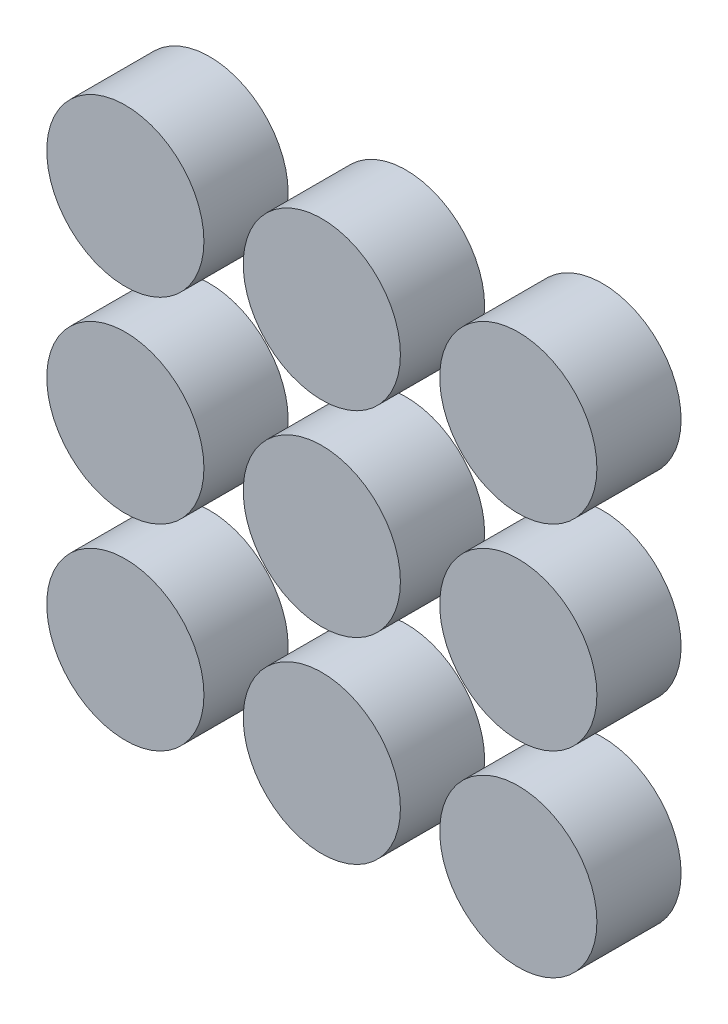
ISO-10303-21;
HEADER;
FILE_DESCRIPTION(('STEP AP214'),'2;1');
FILE_NAME('part.step','',(''),(''),'','','');
FILE_SCHEMA(('AUTOMOTIVE_DESIGN { 1 0 10303 214 1 1 1 1 }'));
ENDSEC;
DATA;
#1=APPLICATION_CONTEXT('core data for automotive mechanical design processes');
#2=APPLICATION_PROTOCOL_DEFINITION('international standard','automotive_design',2000,#1);
#3=PRODUCT_CONTEXT('',#1,'mechanical');
#4=PRODUCT('Part','Part','',(#3));
#5=PRODUCT_RELATED_PRODUCT_CATEGORY('part','',(#4));
#6=PRODUCT_DEFINITION_FORMATION('','',#4);
#7=PRODUCT_DEFINITION_CONTEXT('part definition',#1,'design');
#8=PRODUCT_DEFINITION('design','',#6,#7);
#9=PRODUCT_DEFINITION_SHAPE('','',#8);
#10=(LENGTH_UNIT() NAMED_UNIT(*) SI_UNIT(.MILLI.,.METRE.));
#11=(NAMED_UNIT(*) PLANE_ANGLE_UNIT() SI_UNIT($,.RADIAN.));
#12=(NAMED_UNIT(*) SI_UNIT($,.STERADIAN.) SOLID_ANGLE_UNIT());
#13=UNCERTAINTY_MEASURE_WITH_UNIT(LENGTH_MEASURE(1.E-05),#10,'distance_accuracy_value','');
#14=(GEOMETRIC_REPRESENTATION_CONTEXT(3) GLOBAL_UNCERTAINTY_ASSIGNED_CONTEXT((#13)) GLOBAL_UNIT_ASSIGNED_CONTEXT((#10,
#11,#12)) REPRESENTATION_CONTEXT('',''));
#15=CARTESIAN_POINT('',(0.,0.,0.));
#16=DIRECTION('',(0.,0.,1.));
#17=DIRECTION('',(1.,0.,0.));
#18=AXIS2_PLACEMENT_3D('',#15,#16,#17);
#19=CARTESIAN_POINT('',(-4.46373076906319,-6.71492943372793,13.));
#20=DIRECTION('',(0.,0.,1.));
#21=DIRECTION('',(1.,0.,0.));
#22=AXIS2_PLACEMENT_3D('',#19,#20,#21);
#23=PLANE('',#22);
#24=CARTESIAN_POINT('',(-4.46373076906319,-6.71492943372793,13.));
#25=DIRECTION('',(0.,0.,1.));
#26=DIRECTION('',(1.,0.,0.));
#27=AXIS2_PLACEMENT_3D('',#24,#25,#26);
#28=CIRCLE('',#27,2.8);
#29=CARTESIAN_POINT('',(-1.6637307690632,-6.71492943372793,13.));
#30=VERTEX_POINT('',#29);
#31=EDGE_CURVE('E46',#30,#30,#28,.T.);
#32=ORIENTED_EDGE('',*,*,#31,.T.);
#33=EDGE_LOOP('',(#32));
#34=FACE_BOUND('',#33,.T.);
#35=ADVANCED_FACE('F39',(#34),#23,.T.);
#36=CARTESIAN_POINT('',(-4.46373076906319,-6.71492943372793,13.));
#37=DIRECTION('',(0.,0.,-1.));
#38=DIRECTION('',(-1.,0.,0.));
#39=AXIS2_PLACEMENT_3D('',#36,#37,#38);
#40=CYLINDRICAL_SURFACE('',#39,2.8);
#41=ORIENTED_EDGE('',*,*,#31,.F.);
#42=EDGE_LOOP('',(#41));
#43=FACE_BOUND('',#42,.T.);
#44=CARTESIAN_POINT('',(-4.46373076906319,-6.71492943372793,10.));
#45=DIRECTION('',(0.,0.,1.));
#46=DIRECTION('',(1.,0.,0.));
#47=AXIS2_PLACEMENT_3D('',#44,#45,#46);
#48=CIRCLE('',#47,2.8);
#49=CARTESIAN_POINT('',(-1.6637307690632,-6.71492943372793,10.));
#50=VERTEX_POINT('',#49);
#51=EDGE_CURVE('E11',#50,#50,#48,.T.);
#52=ORIENTED_EDGE('',*,*,#51,.T.);
#53=EDGE_LOOP('',(#52));
#54=FACE_BOUND('',#53,.T.);
#55=ADVANCED_FACE('F53',(#43,#54),#40,.T.);
#56=CARTESIAN_POINT('',(-24.5125871846065,-17.8706086443344,10.));
#57=DIRECTION('',(0.,0.,1.));
#58=DIRECTION('',(1.,0.,0.));
#59=AXIS2_PLACEMENT_3D('',#56,#57,#58);
#60=PLANE('',#59);
#61=ORIENTED_EDGE('',*,*,#51,.F.);
#62=EDGE_LOOP('',(#61));
#63=FACE_BOUND('',#62,.T.);
#64=ADVANCED_FACE('F41',(#63),#60,.F.);
#65=CLOSED_SHELL('',(#35,#55,#64));
#66=MANIFOLD_SOLID_BREP('B2',#65);
#67=CARTESIAN_POINT('',(-11.4637307690632,7.28507056627207,13.));
#68=DIRECTION('',(0.,0.,1.));
#69=DIRECTION('',(1.,0.,0.));
#70=AXIS2_PLACEMENT_3D('',#67,#68,#69);
#71=PLANE('',#70);
#72=CARTESIAN_POINT('',(-11.4637307690632,7.28507056627207,13.));
#73=DIRECTION('',(0.,0.,1.));
#74=DIRECTION('',(1.,0.,0.));
#75=AXIS2_PLACEMENT_3D('',#72,#73,#74);
#76=CIRCLE('',#75,2.8);
#77=CARTESIAN_POINT('',(-8.6637307690632,7.28507056627207,13.));
#78=VERTEX_POINT('',#77);
#79=EDGE_CURVE('E94',#78,#78,#76,.T.);
#80=ORIENTED_EDGE('',*,*,#79,.T.);
#81=EDGE_LOOP('',(#80));
#82=FACE_BOUND('',#81,.T.);
#83=ADVANCED_FACE('F87',(#82),#71,.T.);
#84=CARTESIAN_POINT('',(-11.4637307690632,7.28507056627207,13.));
#85=DIRECTION('',(0.,0.,-1.));
#86=DIRECTION('',(-1.,0.,0.));
#87=AXIS2_PLACEMENT_3D('',#84,#85,#86);
#88=CYLINDRICAL_SURFACE('',#87,2.8);
#89=ORIENTED_EDGE('',*,*,#79,.F.);
#90=EDGE_LOOP('',(#89));
#91=FACE_BOUND('',#90,.T.);
#92=CARTESIAN_POINT('',(-11.4637307690632,7.28507056627207,10.));
#93=DIRECTION('',(0.,0.,1.));
#94=DIRECTION('',(1.,0.,0.));
#95=AXIS2_PLACEMENT_3D('',#92,#93,#94);
#96=CIRCLE('',#95,2.8);
#97=CARTESIAN_POINT('',(-8.6637307690632,7.28507056627207,10.));
#98=VERTEX_POINT('',#97);
#99=EDGE_CURVE('E38',#98,#98,#96,.T.);
#100=ORIENTED_EDGE('',*,*,#99,.T.);
#101=EDGE_LOOP('',(#100));
#102=FACE_BOUND('',#101,.T.);
#103=ADVANCED_FACE('F101',(#91,#102),#88,.T.);
#104=CARTESIAN_POINT('',(-24.5125871846065,-17.8706086443344,10.));
#105=DIRECTION('',(0.,0.,1.));
#106=DIRECTION('',(1.,0.,0.));
#107=AXIS2_PLACEMENT_3D('',#104,#105,#106);
#108=PLANE('',#107);
#109=ORIENTED_EDGE('',*,*,#99,.F.);
#110=EDGE_LOOP('',(#109));
#111=FACE_BOUND('',#110,.T.);
#112=ADVANCED_FACE('F89',(#111),#108,.F.);
#113=CLOSED_SHELL('',(#83,#103,#112));
#114=MANIFOLD_SOLID_BREP('B6',#113);
#115=CARTESIAN_POINT('',(-18.4637307690632,7.28507056627207,13.));
#116=DIRECTION('',(0.,0.,1.));
#117=DIRECTION('',(1.,0.,0.));
#118=AXIS2_PLACEMENT_3D('',#115,#116,#117);
#119=PLANE('',#118);
#120=CARTESIAN_POINT('',(-18.4637307690632,7.28507056627207,13.));
#121=DIRECTION('',(0.,0.,1.));
#122=DIRECTION('',(1.,0.,0.));
#123=AXIS2_PLACEMENT_3D('',#120,#121,#122);
#124=CIRCLE('',#123,2.8);
#125=CARTESIAN_POINT('',(-15.6637307690632,7.28507056627207,13.));
#126=VERTEX_POINT('',#125);
#127=EDGE_CURVE('E142',#126,#126,#124,.T.);
#128=ORIENTED_EDGE('',*,*,#127,.T.);
#129=EDGE_LOOP('',(#128));
#130=FACE_BOUND('',#129,.T.);
#131=ADVANCED_FACE('F135',(#130),#119,.T.);
#132=CARTESIAN_POINT('',(-18.4637307690632,7.28507056627207,13.));
#133=DIRECTION('',(0.,0.,-1.));
#134=DIRECTION('',(-1.,0.,0.));
#135=AXIS2_PLACEMENT_3D('',#132,#133,#134);
#136=CYLINDRICAL_SURFACE('',#135,2.8);
#137=ORIENTED_EDGE('',*,*,#127,.F.);
#138=EDGE_LOOP('',(#137));
#139=FACE_BOUND('',#138,.T.);
#140=CARTESIAN_POINT('',(-18.4637307690632,7.28507056627207,10.));
#141=DIRECTION('',(0.,0.,1.));
#142=DIRECTION('',(1.,0.,0.));
#143=AXIS2_PLACEMENT_3D('',#140,#141,#142);
#144=CIRCLE('',#143,2.8);
#145=CARTESIAN_POINT('',(-15.6637307690632,7.28507056627207,10.));
#146=VERTEX_POINT('',#145);
#147=EDGE_CURVE('E86',#146,#146,#144,.T.);
#148=ORIENTED_EDGE('',*,*,#147,.T.);
#149=EDGE_LOOP('',(#148));
#150=FACE_BOUND('',#149,.T.);
#151=ADVANCED_FACE('F149',(#139,#150),#136,.T.);
#152=CARTESIAN_POINT('',(-24.5125871846065,-17.8706086443344,10.));
#153=DIRECTION('',(0.,0.,1.));
#154=DIRECTION('',(1.,0.,0.));
#155=AXIS2_PLACEMENT_3D('',#152,#153,#154);
#156=PLANE('',#155);
#157=ORIENTED_EDGE('',*,*,#147,.F.);
#158=EDGE_LOOP('',(#157));
#159=FACE_BOUND('',#158,.T.);
#160=ADVANCED_FACE('F137',(#159),#156,.F.);
#161=CLOSED_SHELL('',(#131,#151,#160));
#162=MANIFOLD_SOLID_BREP('B33',#161);
#163=CARTESIAN_POINT('',(-4.46373076906319,7.28507056627207,13.));
#164=DIRECTION('',(0.,0.,1.));
#165=DIRECTION('',(1.,0.,0.));
#166=AXIS2_PLACEMENT_3D('',#163,#164,#165);
#167=PLANE('',#166);
#168=CARTESIAN_POINT('',(-4.46373076906319,7.28507056627207,13.));
#169=DIRECTION('',(0.,0.,1.));
#170=DIRECTION('',(1.,0.,0.));
#171=AXIS2_PLACEMENT_3D('',#168,#169,#170);
#172=CIRCLE('',#171,2.8);
#173=CARTESIAN_POINT('',(-1.6637307690632,7.28507056627207,13.));
#174=VERTEX_POINT('',#173);
#175=EDGE_CURVE('E190',#174,#174,#172,.T.);
#176=ORIENTED_EDGE('',*,*,#175,.T.);
#177=EDGE_LOOP('',(#176));
#178=FACE_BOUND('',#177,.T.);
#179=ADVANCED_FACE('F183',(#178),#167,.T.);
#180=CARTESIAN_POINT('',(-4.46373076906319,7.28507056627207,13.));
#181=DIRECTION('',(0.,0.,-1.));
#182=DIRECTION('',(-1.,0.,0.));
#183=AXIS2_PLACEMENT_3D('',#180,#181,#182);
#184=CYLINDRICAL_SURFACE('',#183,2.8);
#185=ORIENTED_EDGE('',*,*,#175,.F.);
#186=EDGE_LOOP('',(#185));
#187=FACE_BOUND('',#186,.T.);
#188=CARTESIAN_POINT('',(-4.46373076906319,7.28507056627207,10.));
#189=DIRECTION('',(0.,0.,1.));
#190=DIRECTION('',(1.,0.,0.));
#191=AXIS2_PLACEMENT_3D('',#188,#189,#190);
#192=CIRCLE('',#191,2.8);
#193=CARTESIAN_POINT('',(-1.6637307690632,7.28507056627207,10.));
#194=VERTEX_POINT('',#193);
#195=EDGE_CURVE('E134',#194,#194,#192,.T.);
#196=ORIENTED_EDGE('',*,*,#195,.T.);
#197=EDGE_LOOP('',(#196));
#198=FACE_BOUND('',#197,.T.);
#199=ADVANCED_FACE('F197',(#187,#198),#184,.T.);
#200=CARTESIAN_POINT('',(-24.5125871846065,-17.8706086443344,10.));
#201=DIRECTION('',(0.,0.,1.));
#202=DIRECTION('',(1.,0.,0.));
#203=AXIS2_PLACEMENT_3D('',#200,#201,#202);
#204=PLANE('',#203);
#205=ORIENTED_EDGE('',*,*,#195,.F.);
#206=EDGE_LOOP('',(#205));
#207=FACE_BOUND('',#206,.T.);
#208=ADVANCED_FACE('F185',(#207),#204,.F.);
#209=CLOSED_SHELL('',(#179,#199,#208));
#210=MANIFOLD_SOLID_BREP('B81',#209);
#211=CARTESIAN_POINT('',(-18.4637307690632,0.285070566272073,13.));
#212=DIRECTION('',(0.,0.,1.));
#213=DIRECTION('',(1.,0.,0.));
#214=AXIS2_PLACEMENT_3D('',#211,#212,#213);
#215=PLANE('',#214);
#216=CARTESIAN_POINT('',(-18.4637307690632,0.285070566272073,13.));
#217=DIRECTION('',(0.,0.,1.));
#218=DIRECTION('',(1.,0.,0.));
#219=AXIS2_PLACEMENT_3D('',#216,#217,#218);
#220=CIRCLE('',#219,2.8);
#221=CARTESIAN_POINT('',(-15.6637307690632,0.285070566272073,13.));
#222=VERTEX_POINT('',#221);
#223=EDGE_CURVE('E238',#222,#222,#220,.T.);
#224=ORIENTED_EDGE('',*,*,#223,.T.);
#225=EDGE_LOOP('',(#224));
#226=FACE_BOUND('',#225,.T.);
#227=ADVANCED_FACE('F231',(#226),#215,.T.);
#228=CARTESIAN_POINT('',(-18.4637307690632,0.285070566272073,13.));
#229=DIRECTION('',(0.,0.,-1.));
#230=DIRECTION('',(-1.,0.,0.));
#231=AXIS2_PLACEMENT_3D('',#228,#229,#230);
#232=CYLINDRICAL_SURFACE('',#231,2.8);
#233=ORIENTED_EDGE('',*,*,#223,.F.);
#234=EDGE_LOOP('',(#233));
#235=FACE_BOUND('',#234,.T.);
#236=CARTESIAN_POINT('',(-18.4637307690632,0.285070566272073,10.));
#237=DIRECTION('',(0.,0.,1.));
#238=DIRECTION('',(1.,0.,0.));
#239=AXIS2_PLACEMENT_3D('',#236,#237,#238);
#240=CIRCLE('',#239,2.8);
#241=CARTESIAN_POINT('',(-15.6637307690632,0.285070566272073,10.));
#242=VERTEX_POINT('',#241);
#243=EDGE_CURVE('E182',#242,#242,#240,.T.);
#244=ORIENTED_EDGE('',*,*,#243,.T.);
#245=EDGE_LOOP('',(#244));
#246=FACE_BOUND('',#245,.T.);
#247=ADVANCED_FACE('F245',(#235,#246),#232,.T.);
#248=CARTESIAN_POINT('',(-24.5125871846065,-17.8706086443344,10.));
#249=DIRECTION('',(0.,0.,1.));
#250=DIRECTION('',(1.,0.,0.));
#251=AXIS2_PLACEMENT_3D('',#248,#249,#250);
#252=PLANE('',#251);
#253=ORIENTED_EDGE('',*,*,#243,.F.);
#254=EDGE_LOOP('',(#253));
#255=FACE_BOUND('',#254,.T.);
#256=ADVANCED_FACE('F233',(#255),#252,.F.);
#257=CLOSED_SHELL('',(#227,#247,#256));
#258=MANIFOLD_SOLID_BREP('B129',#257);
#259=CARTESIAN_POINT('',(-11.4637307690632,0.285070566272073,13.));
#260=DIRECTION('',(0.,0.,1.));
#261=DIRECTION('',(1.,0.,0.));
#262=AXIS2_PLACEMENT_3D('',#259,#260,#261);
#263=PLANE('',#262);
#264=CARTESIAN_POINT('',(-11.4637307690632,0.285070566272073,13.));
#265=DIRECTION('',(0.,0.,1.));
#266=DIRECTION('',(1.,0.,0.));
#267=AXIS2_PLACEMENT_3D('',#264,#265,#266);
#268=CIRCLE('',#267,2.8);
#269=CARTESIAN_POINT('',(-8.6637307690632,0.285070566272073,13.));
#270=VERTEX_POINT('',#269);
#271=EDGE_CURVE('E286',#270,#270,#268,.T.);
#272=ORIENTED_EDGE('',*,*,#271,.T.);
#273=EDGE_LOOP('',(#272));
#274=FACE_BOUND('',#273,.T.);
#275=ADVANCED_FACE('F279',(#274),#263,.T.);
#276=CARTESIAN_POINT('',(-11.4637307690632,0.285070566272073,13.));
#277=DIRECTION('',(0.,0.,-1.));
#278=DIRECTION('',(-1.,0.,0.));
#279=AXIS2_PLACEMENT_3D('',#276,#277,#278);
#280=CYLINDRICAL_SURFACE('',#279,2.8);
#281=ORIENTED_EDGE('',*,*,#271,.F.);
#282=EDGE_LOOP('',(#281));
#283=FACE_BOUND('',#282,.T.);
#284=CARTESIAN_POINT('',(-11.4637307690632,0.285070566272073,10.));
#285=DIRECTION('',(0.,0.,1.));
#286=DIRECTION('',(1.,0.,0.));
#287=AXIS2_PLACEMENT_3D('',#284,#285,#286);
#288=CIRCLE('',#287,2.8);
#289=CARTESIAN_POINT('',(-8.6637307690632,0.285070566272073,10.));
#290=VERTEX_POINT('',#289);
#291=EDGE_CURVE('E230',#290,#290,#288,.T.);
#292=ORIENTED_EDGE('',*,*,#291,.T.);
#293=EDGE_LOOP('',(#292));
#294=FACE_BOUND('',#293,.T.);
#295=ADVANCED_FACE('F293',(#283,#294),#280,.T.);
#296=CARTESIAN_POINT('',(-24.5125871846065,-17.8706086443344,10.));
#297=DIRECTION('',(0.,0.,1.));
#298=DIRECTION('',(1.,0.,0.));
#299=AXIS2_PLACEMENT_3D('',#296,#297,#298);
#300=PLANE('',#299);
#301=ORIENTED_EDGE('',*,*,#291,.F.);
#302=EDGE_LOOP('',(#301));
#303=FACE_BOUND('',#302,.T.);
#304=ADVANCED_FACE('F281',(#303),#300,.F.);
#305=CLOSED_SHELL('',(#275,#295,#304));
#306=MANIFOLD_SOLID_BREP('B177',#305);
#307=CARTESIAN_POINT('',(-4.46373076906319,0.285070566272073,13.));
#308=DIRECTION('',(0.,0.,1.));
#309=DIRECTION('',(1.,0.,0.));
#310=AXIS2_PLACEMENT_3D('',#307,#308,#309);
#311=PLANE('',#310);
#312=CARTESIAN_POINT('',(-4.46373076906319,0.285070566272073,13.));
#313=DIRECTION('',(0.,0.,1.));
#314=DIRECTION('',(1.,0.,0.));
#315=AXIS2_PLACEMENT_3D('',#312,#313,#314);
#316=CIRCLE('',#315,2.8);
#317=CARTESIAN_POINT('',(-1.6637307690632,0.285070566272073,13.));
#318=VERTEX_POINT('',#317);
#319=EDGE_CURVE('E334',#318,#318,#316,.T.);
#320=ORIENTED_EDGE('',*,*,#319,.T.);
#321=EDGE_LOOP('',(#320));
#322=FACE_BOUND('',#321,.T.);
#323=ADVANCED_FACE('F327',(#322),#311,.T.);
#324=CARTESIAN_POINT('',(-4.46373076906319,0.285070566272073,13.));
#325=DIRECTION('',(0.,0.,-1.));
#326=DIRECTION('',(-1.,0.,0.));
#327=AXIS2_PLACEMENT_3D('',#324,#325,#326);
#328=CYLINDRICAL_SURFACE('',#327,2.8);
#329=ORIENTED_EDGE('',*,*,#319,.F.);
#330=EDGE_LOOP('',(#329));
#331=FACE_BOUND('',#330,.T.);
#332=CARTESIAN_POINT('',(-4.46373076906319,0.285070566272073,10.));
#333=DIRECTION('',(0.,0.,1.));
#334=DIRECTION('',(1.,0.,0.));
#335=AXIS2_PLACEMENT_3D('',#332,#333,#334);
#336=CIRCLE('',#335,2.8);
#337=CARTESIAN_POINT('',(-1.6637307690632,0.285070566272073,10.));
#338=VERTEX_POINT('',#337);
#339=EDGE_CURVE('E278',#338,#338,#336,.T.);
#340=ORIENTED_EDGE('',*,*,#339,.T.);
#341=EDGE_LOOP('',(#340));
#342=FACE_BOUND('',#341,.T.);
#343=ADVANCED_FACE('F341',(#331,#342),#328,.T.);
#344=CARTESIAN_POINT('',(-24.5125871846065,-17.8706086443344,10.));
#345=DIRECTION('',(0.,0.,1.));
#346=DIRECTION('',(1.,0.,0.));
#347=AXIS2_PLACEMENT_3D('',#344,#345,#346);
#348=PLANE('',#347);
#349=ORIENTED_EDGE('',*,*,#339,.F.);
#350=EDGE_LOOP('',(#349));
#351=FACE_BOUND('',#350,.T.);
#352=ADVANCED_FACE('F329',(#351),#348,.F.);
#353=CLOSED_SHELL('',(#323,#343,#352));
#354=MANIFOLD_SOLID_BREP('B225',#353);
#355=CARTESIAN_POINT('',(-18.4637307690632,-6.71492943372793,13.));
#356=DIRECTION('',(0.,0.,1.));
#357=DIRECTION('',(1.,0.,0.));
#358=AXIS2_PLACEMENT_3D('',#355,#356,#357);
#359=PLANE('',#358);
#360=CARTESIAN_POINT('',(-18.4637307690632,-6.71492943372793,13.));
#361=DIRECTION('',(0.,0.,1.));
#362=DIRECTION('',(1.,0.,0.));
#363=AXIS2_PLACEMENT_3D('',#360,#361,#362);
#364=CIRCLE('',#363,2.8);
#365=CARTESIAN_POINT('',(-15.6637307690632,-6.71492943372793,13.));
#366=VERTEX_POINT('',#365);
#367=EDGE_CURVE('E381',#366,#366,#364,.T.);
#368=ORIENTED_EDGE('',*,*,#367,.T.);
#369=EDGE_LOOP('',(#368));
#370=FACE_BOUND('',#369,.T.);
#371=ADVANCED_FACE('F374',(#370),#359,.T.);
#372=CARTESIAN_POINT('',(-18.4637307690632,-6.71492943372793,13.));
#373=DIRECTION('',(0.,0.,-1.));
#374=DIRECTION('',(-1.,0.,0.));
#375=AXIS2_PLACEMENT_3D('',#372,#373,#374);
#376=CYLINDRICAL_SURFACE('',#375,2.8);
#377=ORIENTED_EDGE('',*,*,#367,.F.);
#378=EDGE_LOOP('',(#377));
#379=FACE_BOUND('',#378,.T.);
#380=CARTESIAN_POINT('',(-18.4637307690632,-6.71492943372793,10.));
#381=DIRECTION('',(0.,0.,1.));
#382=DIRECTION('',(1.,0.,0.));
#383=AXIS2_PLACEMENT_3D('',#380,#381,#382);
#384=CIRCLE('',#383,2.8);
#385=CARTESIAN_POINT('',(-15.6637307690632,-6.71492943372793,10.));
#386=VERTEX_POINT('',#385);
#387=EDGE_CURVE('E326',#386,#386,#384,.T.);
#388=ORIENTED_EDGE('',*,*,#387,.T.);
#389=EDGE_LOOP('',(#388));
#390=FACE_BOUND('',#389,.T.);
#391=ADVANCED_FACE('F388',(#379,#390),#376,.T.);
#392=CARTESIAN_POINT('',(-24.5125871846065,-17.8706086443344,10.));
#393=DIRECTION('',(0.,0.,1.));
#394=DIRECTION('',(1.,0.,0.));
#395=AXIS2_PLACEMENT_3D('',#392,#393,#394);
#396=PLANE('',#395);
#397=ORIENTED_EDGE('',*,*,#387,.F.);
#398=EDGE_LOOP('',(#397));
#399=FACE_BOUND('',#398,.T.);
#400=ADVANCED_FACE('F376',(#399),#396,.F.);
#401=CLOSED_SHELL('',(#371,#391,#400));
#402=MANIFOLD_SOLID_BREP('B273',#401);
#403=CARTESIAN_POINT('',(-11.4637307690632,-6.71492943372793,13.));
#404=DIRECTION('',(0.,0.,1.));
#405=DIRECTION('',(1.,0.,0.));
#406=AXIS2_PLACEMENT_3D('',#403,#404,#405);
#407=PLANE('',#406);
#408=CARTESIAN_POINT('',(-11.4637307690632,-6.71492943372793,13.));
#409=DIRECTION('',(0.,0.,1.));
#410=DIRECTION('',(1.,0.,0.));
#411=AXIS2_PLACEMENT_3D('',#408,#409,#410);
#412=CIRCLE('',#411,2.8);
#413=CARTESIAN_POINT('',(-8.6637307690632,-6.71492943372793,13.));
#414=VERTEX_POINT('',#413);
#415=EDGE_CURVE('E373',#414,#414,#412,.T.);
#416=ORIENTED_EDGE('',*,*,#415,.T.);
#417=EDGE_LOOP('',(#416));
#418=FACE_BOUND('',#417,.T.);
#419=ADVANCED_FACE('F414',(#418),#407,.T.);
#420=CARTESIAN_POINT('',(-11.4637307690632,-6.71492943372793,13.));
#421=DIRECTION('',(0.,0.,-1.));
#422=DIRECTION('',(-1.,0.,0.));
#423=AXIS2_PLACEMENT_3D('',#420,#421,#422);
#424=CYLINDRICAL_SURFACE('',#423,2.8);
#425=ORIENTED_EDGE('',*,*,#415,.F.);
#426=EDGE_LOOP('',(#425));
#427=FACE_BOUND('',#426,.T.);
#428=CARTESIAN_POINT('',(-11.4637307690632,-6.71492943372793,10.));
#429=DIRECTION('',(0.,0.,1.));
#430=DIRECTION('',(1.,0.,0.));
#431=AXIS2_PLACEMENT_3D('',#428,#429,#430);
#432=CIRCLE('',#431,2.8);
#433=CARTESIAN_POINT('',(-8.6637307690632,-6.71492943372793,10.));
#434=VERTEX_POINT('',#433);
#435=EDGE_CURVE('E420',#434,#434,#432,.T.);
#436=ORIENTED_EDGE('',*,*,#435,.T.);
#437=EDGE_LOOP('',(#436));
#438=FACE_BOUND('',#437,.T.);
#439=ADVANCED_FACE('F426',(#427,#438),#424,.T.);
#440=CARTESIAN_POINT('',(-24.5125871846065,-17.8706086443344,10.));
#441=DIRECTION('',(0.,0.,1.));
#442=DIRECTION('',(1.,0.,0.));
#443=AXIS2_PLACEMENT_3D('',#440,#441,#442);
#444=PLANE('',#443);
#445=ORIENTED_EDGE('',*,*,#435,.F.);
#446=EDGE_LOOP('',(#445));
#447=FACE_BOUND('',#446,.T.);
#448=ADVANCED_FACE('F428',(#447),#444,.F.);
#449=CLOSED_SHELL('',(#419,#439,#448));
#450=MANIFOLD_SOLID_BREP('B321',#449);
#451=ADVANCED_BREP_SHAPE_REPRESENTATION('',(#18,#66,#114,#162,#210,#258,#306,#354,#402,#450),#14);
#452=SHAPE_DEFINITION_REPRESENTATION(#9,#451);
ENDSEC;
END-ISO-10303-21;
